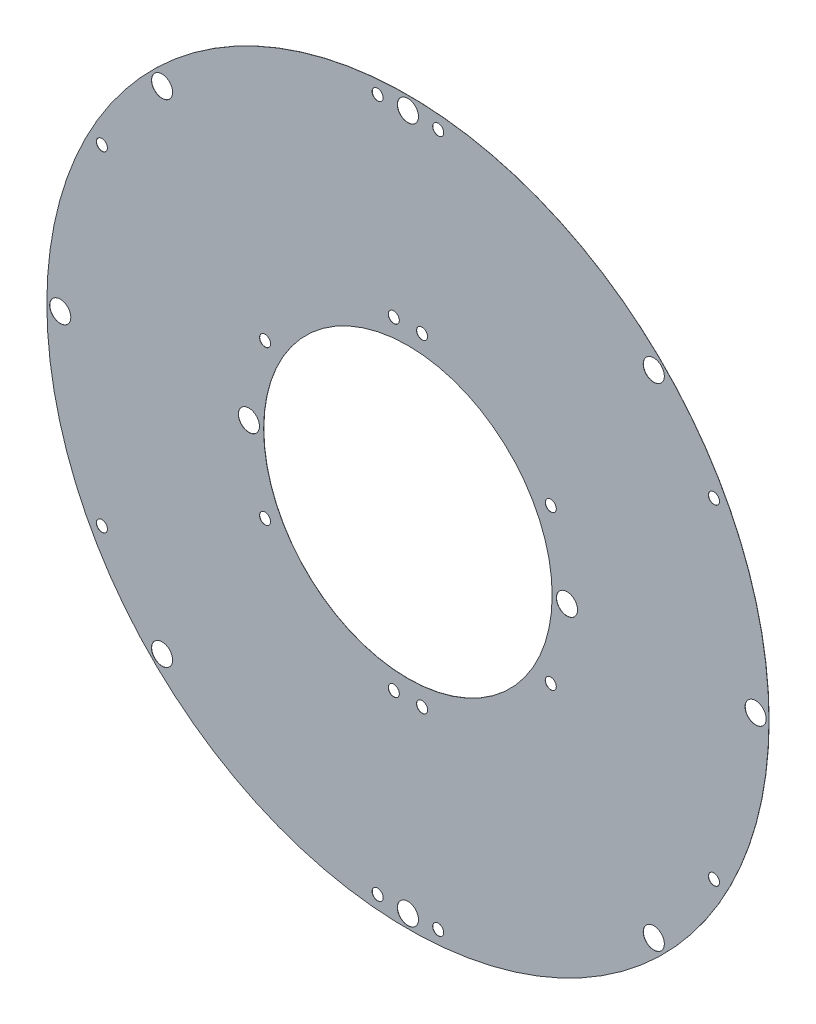
ISO-10303-21;
HEADER;
FILE_DESCRIPTION(('STEP AP214'),'2;1');
FILE_NAME('part.step','',(''),(''),'','','');
FILE_SCHEMA(('AUTOMOTIVE_DESIGN { 1 0 10303 214 1 1 1 1 }'));
ENDSEC;
DATA;
#1=APPLICATION_CONTEXT('core data for automotive mechanical design processes');
#2=APPLICATION_PROTOCOL_DEFINITION('international standard','automotive_design',2000,#1);
#3=PRODUCT_CONTEXT('',#1,'mechanical');
#4=PRODUCT('Part','Part','',(#3));
#5=PRODUCT_RELATED_PRODUCT_CATEGORY('part','',(#4));
#6=PRODUCT_DEFINITION_FORMATION('','',#4);
#7=PRODUCT_DEFINITION_CONTEXT('part definition',#1,'design');
#8=PRODUCT_DEFINITION('design','',#6,#7);
#9=PRODUCT_DEFINITION_SHAPE('','',#8);
#10=(LENGTH_UNIT() NAMED_UNIT(*) SI_UNIT(.MILLI.,.METRE.));
#11=(NAMED_UNIT(*) PLANE_ANGLE_UNIT() SI_UNIT($,.RADIAN.));
#12=(NAMED_UNIT(*) SI_UNIT($,.STERADIAN.) SOLID_ANGLE_UNIT());
#13=UNCERTAINTY_MEASURE_WITH_UNIT(LENGTH_MEASURE(1.E-05),#10,'distance_accuracy_value','');
#14=(GEOMETRIC_REPRESENTATION_CONTEXT(3) GLOBAL_UNCERTAINTY_ASSIGNED_CONTEXT((#13)) GLOBAL_UNIT_ASSIGNED_CONTEXT((#10,
#11,#12)) REPRESENTATION_CONTEXT('',''));
#15=CARTESIAN_POINT('',(0.,0.,0.));
#16=DIRECTION('',(0.,0.,1.));
#17=DIRECTION('',(1.,0.,0.));
#18=AXIS2_PLACEMENT_3D('',#15,#16,#17);
#19=CARTESIAN_POINT('',(0.,0.,-6.35));
#20=DIRECTION('',(0.,0.,-1.));
#21=DIRECTION('',(-1.,0.,0.));
#22=AXIS2_PLACEMENT_3D('',#19,#20,#21);
#23=PLANE('',#22);
#24=CARTESIAN_POINT('',(0.,107.125,-6.35));
#25=DIRECTION('',(0.,0.,-1.));
#26=DIRECTION('',(-1.,0.,0.));
#27=AXIS2_PLACEMENT_3D('',#24,#25,#26);
#28=CIRCLE('',#27,3.25);
#29=CARTESIAN_POINT('',(-3.25,107.125,-6.35));
#30=VERTEX_POINT('',#29);
#31=EDGE_CURVE('E199',#30,#30,#28,.T.);
#32=ORIENTED_EDGE('',*,*,#31,.T.);
#33=EDGE_LOOP('',(#32));
#34=FACE_BOUND('',#33,.T.);
#35=CARTESIAN_POINT('',(75.748813934609,75.7488139346088,-6.35));
#36=DIRECTION('',(0.,0.,-1.));
#37=DIRECTION('',(-1.,0.,0.));
#38=AXIS2_PLACEMENT_3D('',#35,#36,#37);
#39=CIRCLE('',#38,3.25);
#40=CARTESIAN_POINT('',(72.498813934609,75.7488139346088,-6.35));
#41=VERTEX_POINT('',#40);
#42=EDGE_CURVE('E193',#41,#41,#39,.T.);
#43=ORIENTED_EDGE('',*,*,#42,.T.);
#44=EDGE_LOOP('',(#43));
#45=FACE_BOUND('',#44,.T.);
#46=CARTESIAN_POINT('',(107.125,3.44291778045328E-13,-6.35));
#47=DIRECTION('',(0.,0.,-1.));
#48=DIRECTION('',(-1.,0.,0.));
#49=AXIS2_PLACEMENT_3D('',#46,#47,#48);
#50=CIRCLE('',#49,3.25);
#51=CARTESIAN_POINT('',(103.875,3.44291778045328E-13,-6.35));
#52=VERTEX_POINT('',#51);
#53=EDGE_CURVE('E187',#52,#52,#50,.T.);
#54=ORIENTED_EDGE('',*,*,#53,.T.);
#55=EDGE_LOOP('',(#54));
#56=FACE_BOUND('',#55,.T.);
#57=CARTESIAN_POINT('',(75.748813934609,-75.7488139346088,-6.35));
#58=DIRECTION('',(0.,0.,-1.));
#59=DIRECTION('',(-1.,0.,0.));
#60=AXIS2_PLACEMENT_3D('',#57,#58,#59);
#61=CIRCLE('',#60,3.25);
#62=CARTESIAN_POINT('',(72.498813934609,-75.7488139346088,-6.35));
#63=VERTEX_POINT('',#62);
#64=EDGE_CURVE('E181',#63,#63,#61,.T.);
#65=ORIENTED_EDGE('',*,*,#64,.T.);
#66=EDGE_LOOP('',(#65));
#67=FACE_BOUND('',#66,.T.);
#68=CARTESIAN_POINT('',(0.,-107.125,-6.35));
#69=DIRECTION('',(0.,0.,-1.));
#70=DIRECTION('',(-1.,0.,0.));
#71=AXIS2_PLACEMENT_3D('',#68,#69,#70);
#72=CIRCLE('',#71,3.25);
#73=CARTESIAN_POINT('',(-3.25000000000002,-107.125,-6.35));
#74=VERTEX_POINT('',#73);
#75=EDGE_CURVE('E175',#74,#74,#72,.T.);
#76=ORIENTED_EDGE('',*,*,#75,.T.);
#77=EDGE_LOOP('',(#76));
#78=FACE_BOUND('',#77,.T.);
#79=CARTESIAN_POINT('',(-75.748813934608,-75.7488139346098,-6.35));
#80=DIRECTION('',(0.,0.,-1.));
#81=DIRECTION('',(-1.,0.,0.));
#82=AXIS2_PLACEMENT_3D('',#79,#80,#81);
#83=CIRCLE('',#82,3.25);
#84=CARTESIAN_POINT('',(-78.998813934608,-75.7488139346098,-6.35));
#85=VERTEX_POINT('',#84);
#86=EDGE_CURVE('E169',#85,#85,#83,.T.);
#87=ORIENTED_EDGE('',*,*,#86,.T.);
#88=EDGE_LOOP('',(#87));
#89=FACE_BOUND('',#88,.T.);
#90=CARTESIAN_POINT('',(-107.125,-1.09234165489247E-12,-6.35));
#91=DIRECTION('',(0.,0.,-1.));
#92=DIRECTION('',(-1.,0.,0.));
#93=AXIS2_PLACEMENT_3D('',#90,#91,#92);
#94=CIRCLE('',#93,3.25);
#95=CARTESIAN_POINT('',(-110.375,-1.09234165489247E-12,-6.35));
#96=VERTEX_POINT('',#95);
#97=EDGE_CURVE('E163',#96,#96,#94,.T.);
#98=ORIENTED_EDGE('',*,*,#97,.T.);
#99=EDGE_LOOP('',(#98));
#100=FACE_BOUND('',#99,.T.);
#101=CARTESIAN_POINT('',(-49.,0.,-6.35));
#102=DIRECTION('',(0.,0.,-1.));
#103=DIRECTION('',(-1.,0.,0.));
#104=AXIS2_PLACEMENT_3D('',#101,#102,#103);
#105=CIRCLE('',#104,3.25);
#106=CARTESIAN_POINT('',(-52.25,0.,-6.35));
#107=VERTEX_POINT('',#106);
#108=EDGE_CURVE('E157',#107,#107,#105,.T.);
#109=ORIENTED_EDGE('',*,*,#108,.T.);
#110=EDGE_LOOP('',(#109));
#111=FACE_BOUND('',#110,.T.);
#112=CARTESIAN_POINT('',(49.,0.,-6.35));
#113=DIRECTION('',(0.,0.,-1.));
#114=DIRECTION('',(-1.,0.,0.));
#115=AXIS2_PLACEMENT_3D('',#112,#113,#114);
#116=CIRCLE('',#115,3.25);
#117=CARTESIAN_POINT('',(45.75,0.,-6.35));
#118=VERTEX_POINT('',#117);
#119=EDGE_CURVE('E151',#118,#118,#116,.T.);
#120=ORIENTED_EDGE('',*,*,#119,.T.);
#121=EDGE_LOOP('',(#120));
#122=FACE_BOUND('',#121,.T.);
#123=CARTESIAN_POINT('',(-75.748813934608,75.7488139346098,-6.35));
#124=DIRECTION('',(0.,0.,-1.));
#125=DIRECTION('',(-1.,0.,0.));
#126=AXIS2_PLACEMENT_3D('',#123,#124,#125);
#127=CIRCLE('',#126,3.25);
#128=CARTESIAN_POINT('',(-78.998813934608,75.7488139346098,-6.35));
#129=VERTEX_POINT('',#128);
#130=EDGE_CURVE('E36',#129,#129,#127,.T.);
#131=ORIENTED_EDGE('',*,*,#130,.T.);
#132=EDGE_LOOP('',(#131));
#133=FACE_BOUND('',#132,.T.);
#134=CARTESIAN_POINT('',(0.,0.,-6.35));
#135=DIRECTION('',(0.,0.,-1.));
#136=DIRECTION('',(-1.,0.,0.));
#137=AXIS2_PLACEMENT_3D('',#134,#135,#136);
#138=CIRCLE('',#137,44.45);
#139=CARTESIAN_POINT('',(-44.45,0.,-6.35));
#140=VERTEX_POINT('',#139);
#141=EDGE_CURVE('E47',#140,#140,#138,.T.);
#142=ORIENTED_EDGE('',*,*,#141,.T.);
#143=EDGE_LOOP('',(#142));
#144=FACE_BOUND('',#143,.T.);
#145=CARTESIAN_POINT('',(0.,0.,-6.35));
#146=DIRECTION('',(0.,0.,-1.));
#147=DIRECTION('',(-1.,0.,0.));
#148=AXIS2_PLACEMENT_3D('',#145,#146,#147);
#149=CIRCLE('',#148,111.25);
#150=CARTESIAN_POINT('',(-111.25,0.,-6.35));
#151=VERTEX_POINT('',#150);
#152=EDGE_CURVE('E40',#151,#151,#149,.T.);
#153=ORIENTED_EDGE('',*,*,#152,.F.);
#154=EDGE_LOOP('',(#153));
#155=FACE_BOUND('',#154,.T.);
#156=CARTESIAN_POINT('',(44.0100695590055,23.7300184873822,-6.35));
#157=DIRECTION('',(0.,0.,-1.));
#158=DIRECTION('',(-1.,0.,0.));
#159=AXIS2_PLACEMENT_3D('',#156,#157,#158);
#160=CIRCLE('',#159,1.7);
#161=CARTESIAN_POINT('',(42.3100695590054,23.7300184873822,-6.35));
#162=VERTEX_POINT('',#161);
#163=EDGE_CURVE('E50',#162,#162,#160,.T.);
#164=ORIENTED_EDGE('',*,*,#163,.T.);
#165=EDGE_LOOP('',(#164));
#166=FACE_BOUND('',#165,.T.);
#167=CARTESIAN_POINT('',(9.33655894184218,106.717357033078,-6.35));
#168=DIRECTION('',(0.,0.,-1.));
#169=DIRECTION('',(-1.,0.,0.));
#170=AXIS2_PLACEMENT_3D('',#167,#168,#169);
#171=CIRCLE('',#170,1.7);
#172=CARTESIAN_POINT('',(7.63655894184217,106.717357033078,-6.35));
#173=VERTEX_POINT('',#172);
#174=EDGE_CURVE('E58',#173,#173,#171,.T.);
#175=ORIENTED_EDGE('',*,*,#174,.T.);
#176=EDGE_LOOP('',(#175));
#177=FACE_BOUND('',#176,.T.);
#178=CARTESIAN_POINT('',(94.2915740301692,50.8415646092164,-6.35));
#179=DIRECTION('',(0.,0.,-1.));
#180=DIRECTION('',(-1.,0.,0.));
#181=AXIS2_PLACEMENT_3D('',#178,#179,#180);
#182=CIRCLE('',#181,1.69999999999999);
#183=CARTESIAN_POINT('',(92.5915740301692,50.8415646092164,-6.35));
#184=VERTEX_POINT('',#183);
#185=EDGE_CURVE('E64',#184,#184,#182,.T.);
#186=ORIENTED_EDGE('',*,*,#185,.T.);
#187=EDGE_LOOP('',(#186));
#188=FACE_BOUND('',#187,.T.);
#189=CARTESIAN_POINT('',(4.35778713738258,49.8097349045873,-6.35));
#190=DIRECTION('',(0.,0.,-1.));
#191=DIRECTION('',(-1.,0.,0.));
#192=AXIS2_PLACEMENT_3D('',#189,#190,#191);
#193=CIRCLE('',#192,1.7);
#194=CARTESIAN_POINT('',(2.65778713738258,49.8097349045873,-6.35));
#195=VERTEX_POINT('',#194);
#196=EDGE_CURVE('E70',#195,#195,#193,.T.);
#197=ORIENTED_EDGE('',*,*,#196,.T.);
#198=EDGE_LOOP('',(#197));
#199=FACE_BOUND('',#198,.T.);
#200=CARTESIAN_POINT('',(-4.35778713738291,49.8097349045873,-6.35));
#201=DIRECTION('',(0.,0.,-1.));
#202=DIRECTION('',(-1.,0.,0.));
#203=AXIS2_PLACEMENT_3D('',#200,#201,#202);
#204=CIRCLE('',#203,1.7);
#205=CARTESIAN_POINT('',(-6.05778713738291,49.8097349045873,-6.35));
#206=VERTEX_POINT('',#205);
#207=EDGE_CURVE('E76',#206,#206,#204,.T.);
#208=ORIENTED_EDGE('',*,*,#207,.T.);
#209=EDGE_LOOP('',(#208));
#210=FACE_BOUND('',#209,.T.);
#211=CARTESIAN_POINT('',(-44.0100695590056,23.7300184873819,-6.35));
#212=DIRECTION('',(0.,0.,-1.));
#213=DIRECTION('',(-1.,0.,0.));
#214=AXIS2_PLACEMENT_3D('',#211,#212,#213);
#215=CIRCLE('',#214,1.7);
#216=CARTESIAN_POINT('',(-45.7100695590056,23.7300184873819,-6.35));
#217=VERTEX_POINT('',#216);
#218=EDGE_CURVE('E82',#217,#217,#215,.T.);
#219=ORIENTED_EDGE('',*,*,#218,.T.);
#220=EDGE_LOOP('',(#219));
#221=FACE_BOUND('',#220,.T.);
#222=CARTESIAN_POINT('',(-94.2915740301695,50.8415646092158,-6.35));
#223=DIRECTION('',(0.,0.,-1.));
#224=DIRECTION('',(-1.,0.,0.));
#225=AXIS2_PLACEMENT_3D('',#222,#223,#224);
#226=CIRCLE('',#225,1.69999999999999);
#227=CARTESIAN_POINT('',(-95.9915740301695,50.8415646092158,-6.35));
#228=VERTEX_POINT('',#227);
#229=EDGE_CURVE('E88',#228,#228,#226,.T.);
#230=ORIENTED_EDGE('',*,*,#229,.T.);
#231=EDGE_LOOP('',(#230));
#232=FACE_BOUND('',#231,.T.);
#233=CARTESIAN_POINT('',(-9.33655894184289,106.717357033078,-6.35));
#234=DIRECTION('',(0.,0.,-1.));
#235=DIRECTION('',(-1.,0.,0.));
#236=AXIS2_PLACEMENT_3D('',#233,#234,#235);
#237=CIRCLE('',#236,1.7);
#238=CARTESIAN_POINT('',(-11.0365589418429,106.717357033078,-6.35));
#239=VERTEX_POINT('',#238);
#240=EDGE_CURVE('E94',#239,#239,#237,.T.);
#241=ORIENTED_EDGE('',*,*,#240,.T.);
#242=EDGE_LOOP('',(#241));
#243=FACE_BOUND('',#242,.T.);
#244=CARTESIAN_POINT('',(44.0100695590055,-23.7300184873822,-6.35));
#245=DIRECTION('',(0.,0.,-1.));
#246=DIRECTION('',(-1.,0.,0.));
#247=AXIS2_PLACEMENT_3D('',#244,#245,#246);
#248=CIRCLE('',#247,1.7);
#249=CARTESIAN_POINT('',(42.3100695590054,-23.7300184873822,-6.35));
#250=VERTEX_POINT('',#249);
#251=EDGE_CURVE('E100',#250,#250,#248,.T.);
#252=ORIENTED_EDGE('',*,*,#251,.T.);
#253=EDGE_LOOP('',(#252));
#254=FACE_BOUND('',#253,.T.);
#255=CARTESIAN_POINT('',(9.33655894184218,-106.717357033078,-6.35));
#256=DIRECTION('',(0.,0.,-1.));
#257=DIRECTION('',(-1.,0.,0.));
#258=AXIS2_PLACEMENT_3D('',#255,#256,#257);
#259=CIRCLE('',#258,1.7);
#260=CARTESIAN_POINT('',(7.63655894184217,-106.717357033078,-6.35));
#261=VERTEX_POINT('',#260);
#262=EDGE_CURVE('E106',#261,#261,#259,.T.);
#263=ORIENTED_EDGE('',*,*,#262,.T.);
#264=EDGE_LOOP('',(#263));
#265=FACE_BOUND('',#264,.T.);
#266=CARTESIAN_POINT('',(94.2915740301692,-50.8415646092164,-6.35));
#267=DIRECTION('',(0.,0.,-1.));
#268=DIRECTION('',(-1.,0.,0.));
#269=AXIS2_PLACEMENT_3D('',#266,#267,#268);
#270=CIRCLE('',#269,1.69999999999999);
#271=CARTESIAN_POINT('',(92.5915740301692,-50.8415646092164,-6.35));
#272=VERTEX_POINT('',#271);
#273=EDGE_CURVE('E112',#272,#272,#270,.T.);
#274=ORIENTED_EDGE('',*,*,#273,.T.);
#275=EDGE_LOOP('',(#274));
#276=FACE_BOUND('',#275,.T.);
#277=CARTESIAN_POINT('',(4.35778713738258,-49.8097349045873,-6.35));
#278=DIRECTION('',(0.,0.,-1.));
#279=DIRECTION('',(-1.,0.,0.));
#280=AXIS2_PLACEMENT_3D('',#277,#278,#279);
#281=CIRCLE('',#280,1.7);
#282=CARTESIAN_POINT('',(2.65778713738258,-49.8097349045873,-6.35));
#283=VERTEX_POINT('',#282);
#284=EDGE_CURVE('E118',#283,#283,#281,.T.);
#285=ORIENTED_EDGE('',*,*,#284,.T.);
#286=EDGE_LOOP('',(#285));
#287=FACE_BOUND('',#286,.T.);
#288=CARTESIAN_POINT('',(-4.35778713738291,-49.8097349045873,-6.35));
#289=DIRECTION('',(0.,0.,-1.));
#290=DIRECTION('',(-1.,0.,0.));
#291=AXIS2_PLACEMENT_3D('',#288,#289,#290);
#292=CIRCLE('',#291,1.7);
#293=CARTESIAN_POINT('',(-6.05778713738291,-49.8097349045873,-6.35));
#294=VERTEX_POINT('',#293);
#295=EDGE_CURVE('E124',#294,#294,#292,.T.);
#296=ORIENTED_EDGE('',*,*,#295,.T.);
#297=EDGE_LOOP('',(#296));
#298=FACE_BOUND('',#297,.T.);
#299=CARTESIAN_POINT('',(-44.0100695590056,-23.7300184873819,-6.35));
#300=DIRECTION('',(0.,0.,-1.));
#301=DIRECTION('',(-1.,0.,0.));
#302=AXIS2_PLACEMENT_3D('',#299,#300,#301);
#303=CIRCLE('',#302,1.7);
#304=CARTESIAN_POINT('',(-45.7100695590056,-23.7300184873819,-6.35));
#305=VERTEX_POINT('',#304);
#306=EDGE_CURVE('E130',#305,#305,#303,.T.);
#307=ORIENTED_EDGE('',*,*,#306,.T.);
#308=EDGE_LOOP('',(#307));
#309=FACE_BOUND('',#308,.T.);
#310=CARTESIAN_POINT('',(-94.2915740301695,-50.8415646092158,-6.35));
#311=DIRECTION('',(0.,0.,-1.));
#312=DIRECTION('',(-1.,0.,0.));
#313=AXIS2_PLACEMENT_3D('',#310,#311,#312);
#314=CIRCLE('',#313,1.69999999999999);
#315=CARTESIAN_POINT('',(-95.9915740301695,-50.8415646092158,-6.35));
#316=VERTEX_POINT('',#315);
#317=EDGE_CURVE('E136',#316,#316,#314,.T.);
#318=ORIENTED_EDGE('',*,*,#317,.T.);
#319=EDGE_LOOP('',(#318));
#320=FACE_BOUND('',#319,.T.);
#321=CARTESIAN_POINT('',(-9.33655894184289,-106.717357033078,-6.35));
#322=DIRECTION('',(0.,0.,-1.));
#323=DIRECTION('',(-1.,0.,0.));
#324=AXIS2_PLACEMENT_3D('',#321,#322,#323);
#325=CIRCLE('',#324,1.7);
#326=CARTESIAN_POINT('',(-11.0365589418429,-106.717357033078,-6.35));
#327=VERTEX_POINT('',#326);
#328=EDGE_CURVE('E142',#327,#327,#325,.T.);
#329=ORIENTED_EDGE('',*,*,#328,.T.);
#330=EDGE_LOOP('',(#329));
#331=FACE_BOUND('',#330,.T.);
#332=ADVANCED_FACE('F32',(#34,#45,#56,#67,#78,#89,#100,#111,#122,#133,#144,#155,#166,#177,#188,
#199,#210,#221,#232,#243,#254,#265,#276,#287,#298,#309,#320,#331),#23,.F.);
#333=CARTESIAN_POINT('',(0.,0.,-6.4));
#334=DIRECTION('',(0.,0.,-1.));
#335=DIRECTION('',(-1.,0.,0.));
#336=AXIS2_PLACEMENT_3D('',#333,#334,#335);
#337=PLANE('',#336);
#338=CARTESIAN_POINT('',(0.,107.125,-6.4));
#339=DIRECTION('',(0.,0.,-1.));
#340=DIRECTION('',(-1.,0.,0.));
#341=AXIS2_PLACEMENT_3D('',#338,#339,#340);
#342=CIRCLE('',#341,3.25);
#343=CARTESIAN_POINT('',(-3.25,107.125,-6.4));
#344=VERTEX_POINT('',#343);
#345=EDGE_CURVE('E202',#344,#344,#342,.T.);
#346=ORIENTED_EDGE('',*,*,#345,.F.);
#347=EDGE_LOOP('',(#346));
#348=FACE_BOUND('',#347,.T.);
#349=CARTESIAN_POINT('',(75.748813934609,75.7488139346088,-6.4));
#350=DIRECTION('',(0.,0.,-1.));
#351=DIRECTION('',(-1.,0.,0.));
#352=AXIS2_PLACEMENT_3D('',#349,#350,#351);
#353=CIRCLE('',#352,3.25);
#354=CARTESIAN_POINT('',(72.498813934609,75.7488139346088,-6.4));
#355=VERTEX_POINT('',#354);
#356=EDGE_CURVE('E196',#355,#355,#353,.T.);
#357=ORIENTED_EDGE('',*,*,#356,.F.);
#358=EDGE_LOOP('',(#357));
#359=FACE_BOUND('',#358,.T.);
#360=CARTESIAN_POINT('',(107.125,3.44291778045328E-13,-6.4));
#361=DIRECTION('',(0.,0.,-1.));
#362=DIRECTION('',(-1.,0.,0.));
#363=AXIS2_PLACEMENT_3D('',#360,#361,#362);
#364=CIRCLE('',#363,3.25);
#365=CARTESIAN_POINT('',(103.875,3.44291778045328E-13,-6.4));
#366=VERTEX_POINT('',#365);
#367=EDGE_CURVE('E190',#366,#366,#364,.T.);
#368=ORIENTED_EDGE('',*,*,#367,.F.);
#369=EDGE_LOOP('',(#368));
#370=FACE_BOUND('',#369,.T.);
#371=CARTESIAN_POINT('',(75.748813934609,-75.7488139346088,-6.4));
#372=DIRECTION('',(0.,0.,-1.));
#373=DIRECTION('',(-1.,0.,0.));
#374=AXIS2_PLACEMENT_3D('',#371,#372,#373);
#375=CIRCLE('',#374,3.25);
#376=CARTESIAN_POINT('',(72.498813934609,-75.7488139346088,-6.4));
#377=VERTEX_POINT('',#376);
#378=EDGE_CURVE('E184',#377,#377,#375,.T.);
#379=ORIENTED_EDGE('',*,*,#378,.F.);
#380=EDGE_LOOP('',(#379));
#381=FACE_BOUND('',#380,.T.);
#382=CARTESIAN_POINT('',(0.,-107.125,-6.4));
#383=DIRECTION('',(0.,0.,-1.));
#384=DIRECTION('',(-1.,0.,0.));
#385=AXIS2_PLACEMENT_3D('',#382,#383,#384);
#386=CIRCLE('',#385,3.25);
#387=CARTESIAN_POINT('',(-3.25000000000002,-107.125,-6.4));
#388=VERTEX_POINT('',#387);
#389=EDGE_CURVE('E178',#388,#388,#386,.T.);
#390=ORIENTED_EDGE('',*,*,#389,.F.);
#391=EDGE_LOOP('',(#390));
#392=FACE_BOUND('',#391,.T.);
#393=CARTESIAN_POINT('',(-75.748813934608,-75.7488139346098,-6.4));
#394=DIRECTION('',(0.,0.,-1.));
#395=DIRECTION('',(-1.,0.,0.));
#396=AXIS2_PLACEMENT_3D('',#393,#394,#395);
#397=CIRCLE('',#396,3.25);
#398=CARTESIAN_POINT('',(-78.998813934608,-75.7488139346098,-6.4));
#399=VERTEX_POINT('',#398);
#400=EDGE_CURVE('E172',#399,#399,#397,.T.);
#401=ORIENTED_EDGE('',*,*,#400,.F.);
#402=EDGE_LOOP('',(#401));
#403=FACE_BOUND('',#402,.T.);
#404=CARTESIAN_POINT('',(-107.125,-1.09234165489247E-12,-6.4));
#405=DIRECTION('',(0.,0.,-1.));
#406=DIRECTION('',(-1.,0.,0.));
#407=AXIS2_PLACEMENT_3D('',#404,#405,#406);
#408=CIRCLE('',#407,3.25);
#409=CARTESIAN_POINT('',(-110.375,-1.09234165489247E-12,-6.4));
#410=VERTEX_POINT('',#409);
#411=EDGE_CURVE('E166',#410,#410,#408,.T.);
#412=ORIENTED_EDGE('',*,*,#411,.F.);
#413=EDGE_LOOP('',(#412));
#414=FACE_BOUND('',#413,.T.);
#415=CARTESIAN_POINT('',(-49.,0.,-6.4));
#416=DIRECTION('',(0.,0.,-1.));
#417=DIRECTION('',(-1.,0.,0.));
#418=AXIS2_PLACEMENT_3D('',#415,#416,#417);
#419=CIRCLE('',#418,3.25);
#420=CARTESIAN_POINT('',(-52.25,0.,-6.4));
#421=VERTEX_POINT('',#420);
#422=EDGE_CURVE('E160',#421,#421,#419,.T.);
#423=ORIENTED_EDGE('',*,*,#422,.F.);
#424=EDGE_LOOP('',(#423));
#425=FACE_BOUND('',#424,.T.);
#426=CARTESIAN_POINT('',(49.,0.,-6.4));
#427=DIRECTION('',(0.,0.,-1.));
#428=DIRECTION('',(-1.,0.,0.));
#429=AXIS2_PLACEMENT_3D('',#426,#427,#428);
#430=CIRCLE('',#429,3.25);
#431=CARTESIAN_POINT('',(45.75,0.,-6.4));
#432=VERTEX_POINT('',#431);
#433=EDGE_CURVE('E154',#432,#432,#430,.T.);
#434=ORIENTED_EDGE('',*,*,#433,.F.);
#435=EDGE_LOOP('',(#434));
#436=FACE_BOUND('',#435,.T.);
#437=CARTESIAN_POINT('',(-75.748813934608,75.7488139346098,-6.4));
#438=DIRECTION('',(0.,0.,-1.));
#439=DIRECTION('',(-1.,0.,0.));
#440=AXIS2_PLACEMENT_3D('',#437,#438,#439);
#441=CIRCLE('',#440,3.25);
#442=CARTESIAN_POINT('',(-78.998813934608,75.7488139346098,-6.4));
#443=VERTEX_POINT('',#442);
#444=EDGE_CURVE('E148',#443,#443,#441,.T.);
#445=ORIENTED_EDGE('',*,*,#444,.F.);
#446=EDGE_LOOP('',(#445));
#447=FACE_BOUND('',#446,.T.);
#448=CARTESIAN_POINT('',(-9.33655894184289,-106.717357033078,-6.4));
#449=DIRECTION('',(0.,0.,-1.));
#450=DIRECTION('',(-1.,0.,0.));
#451=AXIS2_PLACEMENT_3D('',#448,#449,#450);
#452=CIRCLE('',#451,1.69999999999999);
#453=CARTESIAN_POINT('',(-11.0365589418429,-106.717357033078,-6.4));
#454=VERTEX_POINT('',#453);
#455=EDGE_CURVE('E145',#454,#454,#452,.T.);
#456=ORIENTED_EDGE('',*,*,#455,.F.);
#457=EDGE_LOOP('',(#456));
#458=FACE_BOUND('',#457,.T.);
#459=CARTESIAN_POINT('',(-94.2915740301695,-50.8415646092158,-6.4));
#460=DIRECTION('',(0.,0.,-1.));
#461=DIRECTION('',(-1.,0.,0.));
#462=AXIS2_PLACEMENT_3D('',#459,#460,#461);
#463=CIRCLE('',#462,1.69999999999999);
#464=CARTESIAN_POINT('',(-95.9915740301695,-50.8415646092158,-6.4));
#465=VERTEX_POINT('',#464);
#466=EDGE_CURVE('E139',#465,#465,#463,.T.);
#467=ORIENTED_EDGE('',*,*,#466,.F.);
#468=EDGE_LOOP('',(#467));
#469=FACE_BOUND('',#468,.T.);
#470=CARTESIAN_POINT('',(-44.0100695590056,-23.7300184873819,-6.4));
#471=DIRECTION('',(0.,0.,-1.));
#472=DIRECTION('',(-1.,0.,0.));
#473=AXIS2_PLACEMENT_3D('',#470,#471,#472);
#474=CIRCLE('',#473,1.69999999999999);
#475=CARTESIAN_POINT('',(-45.7100695590056,-23.7300184873819,-6.4));
#476=VERTEX_POINT('',#475);
#477=EDGE_CURVE('E133',#476,#476,#474,.T.);
#478=ORIENTED_EDGE('',*,*,#477,.F.);
#479=EDGE_LOOP('',(#478));
#480=FACE_BOUND('',#479,.T.);
#481=CARTESIAN_POINT('',(-4.35778713738291,-49.8097349045873,-6.4));
#482=DIRECTION('',(0.,0.,-1.));
#483=DIRECTION('',(-1.,0.,0.));
#484=AXIS2_PLACEMENT_3D('',#481,#482,#483);
#485=CIRCLE('',#484,1.69999999999999);
#486=CARTESIAN_POINT('',(-6.0577871373829,-49.8097349045873,-6.4));
#487=VERTEX_POINT('',#486);
#488=EDGE_CURVE('E127',#487,#487,#485,.T.);
#489=ORIENTED_EDGE('',*,*,#488,.F.);
#490=EDGE_LOOP('',(#489));
#491=FACE_BOUND('',#490,.T.);
#492=CARTESIAN_POINT('',(4.35778713738258,-49.8097349045873,-6.4));
#493=DIRECTION('',(0.,0.,-1.));
#494=DIRECTION('',(-1.,0.,0.));
#495=AXIS2_PLACEMENT_3D('',#492,#493,#494);
#496=CIRCLE('',#495,1.69999999999999);
#497=CARTESIAN_POINT('',(2.65778713738259,-49.8097349045873,-6.4));
#498=VERTEX_POINT('',#497);
#499=EDGE_CURVE('E121',#498,#498,#496,.T.);
#500=ORIENTED_EDGE('',*,*,#499,.F.);
#501=EDGE_LOOP('',(#500));
#502=FACE_BOUND('',#501,.T.);
#503=CARTESIAN_POINT('',(94.2915740301692,-50.8415646092164,-6.4));
#504=DIRECTION('',(0.,0.,-1.));
#505=DIRECTION('',(-1.,0.,0.));
#506=AXIS2_PLACEMENT_3D('',#503,#504,#505);
#507=CIRCLE('',#506,1.69999999999999);
#508=CARTESIAN_POINT('',(92.5915740301692,-50.8415646092164,-6.4));
#509=VERTEX_POINT('',#508);
#510=EDGE_CURVE('E115',#509,#509,#507,.T.);
#511=ORIENTED_EDGE('',*,*,#510,.F.);
#512=EDGE_LOOP('',(#511));
#513=FACE_BOUND('',#512,.T.);
#514=CARTESIAN_POINT('',(9.33655894184218,-106.717357033078,-6.4));
#515=DIRECTION('',(0.,0.,-1.));
#516=DIRECTION('',(-1.,0.,0.));
#517=AXIS2_PLACEMENT_3D('',#514,#515,#516);
#518=CIRCLE('',#517,1.69999999999999);
#519=CARTESIAN_POINT('',(7.63655894184219,-106.717357033078,-6.4));
#520=VERTEX_POINT('',#519);
#521=EDGE_CURVE('E109',#520,#520,#518,.T.);
#522=ORIENTED_EDGE('',*,*,#521,.F.);
#523=EDGE_LOOP('',(#522));
#524=FACE_BOUND('',#523,.T.);
#525=CARTESIAN_POINT('',(44.0100695590055,-23.7300184873822,-6.4));
#526=DIRECTION('',(0.,0.,-1.));
#527=DIRECTION('',(-1.,0.,0.));
#528=AXIS2_PLACEMENT_3D('',#525,#526,#527);
#529=CIRCLE('',#528,1.69999999999999);
#530=CARTESIAN_POINT('',(42.3100695590055,-23.7300184873822,-6.4));
#531=VERTEX_POINT('',#530);
#532=EDGE_CURVE('E103',#531,#531,#529,.T.);
#533=ORIENTED_EDGE('',*,*,#532,.F.);
#534=EDGE_LOOP('',(#533));
#535=FACE_BOUND('',#534,.T.);
#536=CARTESIAN_POINT('',(-9.33655894184289,106.717357033078,-6.4));
#537=DIRECTION('',(0.,0.,-1.));
#538=DIRECTION('',(-1.,0.,0.));
#539=AXIS2_PLACEMENT_3D('',#536,#537,#538);
#540=CIRCLE('',#539,1.69999999999999);
#541=CARTESIAN_POINT('',(-11.0365589418429,106.717357033078,-6.4));
#542=VERTEX_POINT('',#541);
#543=EDGE_CURVE('E97',#542,#542,#540,.T.);
#544=ORIENTED_EDGE('',*,*,#543,.F.);
#545=EDGE_LOOP('',(#544));
#546=FACE_BOUND('',#545,.T.);
#547=CARTESIAN_POINT('',(-94.2915740301695,50.8415646092158,-6.4));
#548=DIRECTION('',(0.,0.,-1.));
#549=DIRECTION('',(-1.,0.,0.));
#550=AXIS2_PLACEMENT_3D('',#547,#548,#549);
#551=CIRCLE('',#550,1.69999999999999);
#552=CARTESIAN_POINT('',(-95.9915740301695,50.8415646092158,-6.4));
#553=VERTEX_POINT('',#552);
#554=EDGE_CURVE('E91',#553,#553,#551,.T.);
#555=ORIENTED_EDGE('',*,*,#554,.F.);
#556=EDGE_LOOP('',(#555));
#557=FACE_BOUND('',#556,.T.);
#558=CARTESIAN_POINT('',(-44.0100695590056,23.7300184873819,-6.4));
#559=DIRECTION('',(0.,0.,-1.));
#560=DIRECTION('',(-1.,0.,0.));
#561=AXIS2_PLACEMENT_3D('',#558,#559,#560);
#562=CIRCLE('',#561,1.69999999999999);
#563=CARTESIAN_POINT('',(-45.7100695590056,23.7300184873819,-6.4));
#564=VERTEX_POINT('',#563);
#565=EDGE_CURVE('E85',#564,#564,#562,.T.);
#566=ORIENTED_EDGE('',*,*,#565,.F.);
#567=EDGE_LOOP('',(#566));
#568=FACE_BOUND('',#567,.T.);
#569=CARTESIAN_POINT('',(-4.35778713738291,49.8097349045873,-6.4));
#570=DIRECTION('',(0.,0.,-1.));
#571=DIRECTION('',(-1.,0.,0.));
#572=AXIS2_PLACEMENT_3D('',#569,#570,#571);
#573=CIRCLE('',#572,1.69999999999999);
#574=CARTESIAN_POINT('',(-6.0577871373829,49.8097349045873,-6.4));
#575=VERTEX_POINT('',#574);
#576=EDGE_CURVE('E79',#575,#575,#573,.T.);
#577=ORIENTED_EDGE('',*,*,#576,.F.);
#578=EDGE_LOOP('',(#577));
#579=FACE_BOUND('',#578,.T.);
#580=CARTESIAN_POINT('',(4.35778713738258,49.8097349045873,-6.4));
#581=DIRECTION('',(0.,0.,-1.));
#582=DIRECTION('',(-1.,0.,0.));
#583=AXIS2_PLACEMENT_3D('',#580,#581,#582);
#584=CIRCLE('',#583,1.69999999999999);
#585=CARTESIAN_POINT('',(2.65778713738259,49.8097349045873,-6.4));
#586=VERTEX_POINT('',#585);
#587=EDGE_CURVE('E73',#586,#586,#584,.T.);
#588=ORIENTED_EDGE('',*,*,#587,.F.);
#589=EDGE_LOOP('',(#588));
#590=FACE_BOUND('',#589,.T.);
#591=CARTESIAN_POINT('',(94.2915740301692,50.8415646092164,-6.4));
#592=DIRECTION('',(0.,0.,-1.));
#593=DIRECTION('',(-1.,0.,0.));
#594=AXIS2_PLACEMENT_3D('',#591,#592,#593);
#595=CIRCLE('',#594,1.69999999999999);
#596=CARTESIAN_POINT('',(92.5915740301692,50.8415646092164,-6.4));
#597=VERTEX_POINT('',#596);
#598=EDGE_CURVE('E67',#597,#597,#595,.T.);
#599=ORIENTED_EDGE('',*,*,#598,.F.);
#600=EDGE_LOOP('',(#599));
#601=FACE_BOUND('',#600,.T.);
#602=CARTESIAN_POINT('',(9.33655894184218,106.717357033078,-6.4));
#603=DIRECTION('',(0.,0.,-1.));
#604=DIRECTION('',(-1.,0.,0.));
#605=AXIS2_PLACEMENT_3D('',#602,#603,#604);
#606=CIRCLE('',#605,1.69999999999999);
#607=CARTESIAN_POINT('',(7.63655894184219,106.717357033078,-6.4));
#608=VERTEX_POINT('',#607);
#609=EDGE_CURVE('E61',#608,#608,#606,.T.);
#610=ORIENTED_EDGE('',*,*,#609,.F.);
#611=EDGE_LOOP('',(#610));
#612=FACE_BOUND('',#611,.T.);
#613=CARTESIAN_POINT('',(44.0100695590055,23.7300184873822,-6.4));
#614=DIRECTION('',(0.,0.,-1.));
#615=DIRECTION('',(-1.,0.,0.));
#616=AXIS2_PLACEMENT_3D('',#613,#614,#615);
#617=CIRCLE('',#616,1.69999999999999);
#618=CARTESIAN_POINT('',(42.3100695590055,23.7300184873822,-6.4));
#619=VERTEX_POINT('',#618);
#620=EDGE_CURVE('E55',#619,#619,#617,.T.);
#621=ORIENTED_EDGE('',*,*,#620,.F.);
#622=EDGE_LOOP('',(#621));
#623=FACE_BOUND('',#622,.T.);
#624=CARTESIAN_POINT('',(0.,0.,-6.4));
#625=DIRECTION('',(0.,0.,-1.));
#626=DIRECTION('',(-1.,0.,0.));
#627=AXIS2_PLACEMENT_3D('',#624,#625,#626);
#628=CIRCLE('',#627,111.25);
#629=CARTESIAN_POINT('',(-111.25,0.,-6.4));
#630=VERTEX_POINT('',#629);
#631=EDGE_CURVE('E10',#630,#630,#628,.T.);
#632=ORIENTED_EDGE('',*,*,#631,.T.);
#633=EDGE_LOOP('',(#632));
#634=FACE_BOUND('',#633,.T.);
#635=CARTESIAN_POINT('',(0.,0.,-6.4));
#636=DIRECTION('',(0.,0.,-1.));
#637=DIRECTION('',(-1.,0.,0.));
#638=AXIS2_PLACEMENT_3D('',#635,#636,#637);
#639=CIRCLE('',#638,44.45);
#640=CARTESIAN_POINT('',(-44.45,0.,-6.4));
#641=VERTEX_POINT('',#640);
#642=EDGE_CURVE('E45',#641,#641,#639,.T.);
#643=ORIENTED_EDGE('',*,*,#642,.F.);
#644=EDGE_LOOP('',(#643));
#645=FACE_BOUND('',#644,.T.);
#646=ADVANCED_FACE('F209',(#348,#359,#370,#381,#392,#403,#414,#425,#436,#447,#458,#469,#480,
#491,#502,#513,#524,#535,#546,#557,#568,#579,#590,#601,#612,#623,#634,#645),#337,.T.);
#647=CARTESIAN_POINT('',(0.,0.,-6.4));
#648=DIRECTION('',(0.,0.,1.));
#649=DIRECTION('',(1.,0.,0.));
#650=AXIS2_PLACEMENT_3D('',#647,#648,#649);
#651=CYLINDRICAL_SURFACE('',#650,111.25);
#652=ORIENTED_EDGE('',*,*,#631,.F.);
#653=EDGE_LOOP('',(#652));
#654=FACE_BOUND('',#653,.T.);
#655=ORIENTED_EDGE('',*,*,#152,.T.);
#656=EDGE_LOOP('',(#655));
#657=FACE_BOUND('',#656,.T.);
#658=ADVANCED_FACE('F34',(#654,#657),#651,.T.);
#659=CARTESIAN_POINT('',(0.,0.,-6.4));
#660=DIRECTION('',(0.,0.,1.));
#661=DIRECTION('',(1.,0.,0.));
#662=AXIS2_PLACEMENT_3D('',#659,#660,#661);
#663=CYLINDRICAL_SURFACE('',#662,44.45);
#664=ORIENTED_EDGE('',*,*,#642,.T.);
#665=EDGE_LOOP('',(#664));
#666=FACE_BOUND('',#665,.T.);
#667=ORIENTED_EDGE('',*,*,#141,.F.);
#668=EDGE_LOOP('',(#667));
#669=FACE_BOUND('',#668,.T.);
#670=ADVANCED_FACE('F265',(#666,#669),#663,.F.);
#671=CARTESIAN_POINT('',(44.0100695590055,23.7300184873822,-6.4));
#672=DIRECTION('',(0.,0.,-1.));
#673=DIRECTION('',(-1.,0.,0.));
#674=AXIS2_PLACEMENT_3D('',#671,#672,#673);
#675=CYLINDRICAL_SURFACE('',#674,1.69999999999999);
#676=ORIENTED_EDGE('',*,*,#163,.F.);
#677=EDGE_LOOP('',(#676));
#678=FACE_BOUND('',#677,.T.);
#679=ORIENTED_EDGE('',*,*,#620,.T.);
#680=EDGE_LOOP('',(#679));
#681=FACE_BOUND('',#680,.T.);
#682=ADVANCED_FACE('F268',(#678,#681),#675,.F.);
#683=CARTESIAN_POINT('',(9.33655894184218,106.717357033078,-6.4));
#684=DIRECTION('',(0.,0.,-1.));
#685=DIRECTION('',(-1.,0.,0.));
#686=AXIS2_PLACEMENT_3D('',#683,#684,#685);
#687=CYLINDRICAL_SURFACE('',#686,1.69999999999999);
#688=ORIENTED_EDGE('',*,*,#174,.F.);
#689=EDGE_LOOP('',(#688));
#690=FACE_BOUND('',#689,.T.);
#691=ORIENTED_EDGE('',*,*,#609,.T.);
#692=EDGE_LOOP('',(#691));
#693=FACE_BOUND('',#692,.T.);
#694=ADVANCED_FACE('F373',(#690,#693),#687,.F.);
#695=CARTESIAN_POINT('',(94.2915740301692,50.8415646092164,-6.4));
#696=DIRECTION('',(0.,0.,-1.));
#697=DIRECTION('',(-1.,0.,0.));
#698=AXIS2_PLACEMENT_3D('',#695,#696,#697);
#699=CYLINDRICAL_SURFACE('',#698,1.69999999999999);
#700=ORIENTED_EDGE('',*,*,#185,.F.);
#701=EDGE_LOOP('',(#700));
#702=FACE_BOUND('',#701,.T.);
#703=ORIENTED_EDGE('',*,*,#598,.T.);
#704=EDGE_LOOP('',(#703));
#705=FACE_BOUND('',#704,.T.);
#706=ADVANCED_FACE('F369',(#702,#705),#699,.F.);
#707=CARTESIAN_POINT('',(4.35778713738258,49.8097349045873,-6.4));
#708=DIRECTION('',(0.,0.,-1.));
#709=DIRECTION('',(-1.,0.,0.));
#710=AXIS2_PLACEMENT_3D('',#707,#708,#709);
#711=CYLINDRICAL_SURFACE('',#710,1.69999999999999);
#712=ORIENTED_EDGE('',*,*,#196,.F.);
#713=EDGE_LOOP('',(#712));
#714=FACE_BOUND('',#713,.T.);
#715=ORIENTED_EDGE('',*,*,#587,.T.);
#716=EDGE_LOOP('',(#715));
#717=FACE_BOUND('',#716,.T.);
#718=ADVANCED_FACE('F365',(#714,#717),#711,.F.);
#719=CARTESIAN_POINT('',(-4.35778713738291,49.8097349045873,-6.4));
#720=DIRECTION('',(0.,0.,-1.));
#721=DIRECTION('',(-1.,0.,0.));
#722=AXIS2_PLACEMENT_3D('',#719,#720,#721);
#723=CYLINDRICAL_SURFACE('',#722,1.69999999999999);
#724=ORIENTED_EDGE('',*,*,#207,.F.);
#725=EDGE_LOOP('',(#724));
#726=FACE_BOUND('',#725,.T.);
#727=ORIENTED_EDGE('',*,*,#576,.T.);
#728=EDGE_LOOP('',(#727));
#729=FACE_BOUND('',#728,.T.);
#730=ADVANCED_FACE('F361',(#726,#729),#723,.F.);
#731=CARTESIAN_POINT('',(-44.0100695590056,23.7300184873819,-6.4));
#732=DIRECTION('',(0.,0.,-1.));
#733=DIRECTION('',(-1.,0.,0.));
#734=AXIS2_PLACEMENT_3D('',#731,#732,#733);
#735=CYLINDRICAL_SURFACE('',#734,1.69999999999999);
#736=ORIENTED_EDGE('',*,*,#218,.F.);
#737=EDGE_LOOP('',(#736));
#738=FACE_BOUND('',#737,.T.);
#739=ORIENTED_EDGE('',*,*,#565,.T.);
#740=EDGE_LOOP('',(#739));
#741=FACE_BOUND('',#740,.T.);
#742=ADVANCED_FACE('F357',(#738,#741),#735,.F.);
#743=CARTESIAN_POINT('',(-94.2915740301695,50.8415646092158,-6.4));
#744=DIRECTION('',(0.,0.,-1.));
#745=DIRECTION('',(-1.,0.,0.));
#746=AXIS2_PLACEMENT_3D('',#743,#744,#745);
#747=CYLINDRICAL_SURFACE('',#746,1.69999999999999);
#748=ORIENTED_EDGE('',*,*,#229,.F.);
#749=EDGE_LOOP('',(#748));
#750=FACE_BOUND('',#749,.T.);
#751=ORIENTED_EDGE('',*,*,#554,.T.);
#752=EDGE_LOOP('',(#751));
#753=FACE_BOUND('',#752,.T.);
#754=ADVANCED_FACE('F353',(#750,#753),#747,.F.);
#755=CARTESIAN_POINT('',(-9.33655894184289,106.717357033078,-6.4));
#756=DIRECTION('',(0.,0.,-1.));
#757=DIRECTION('',(-1.,0.,0.));
#758=AXIS2_PLACEMENT_3D('',#755,#756,#757);
#759=CYLINDRICAL_SURFACE('',#758,1.69999999999999);
#760=ORIENTED_EDGE('',*,*,#240,.F.);
#761=EDGE_LOOP('',(#760));
#762=FACE_BOUND('',#761,.T.);
#763=ORIENTED_EDGE('',*,*,#543,.T.);
#764=EDGE_LOOP('',(#763));
#765=FACE_BOUND('',#764,.T.);
#766=ADVANCED_FACE('F349',(#762,#765),#759,.F.);
#767=CARTESIAN_POINT('',(44.0100695590055,-23.7300184873822,-6.4));
#768=DIRECTION('',(0.,0.,-1.));
#769=DIRECTION('',(-1.,0.,0.));
#770=AXIS2_PLACEMENT_3D('',#767,#768,#769);
#771=CYLINDRICAL_SURFACE('',#770,1.69999999999999);
#772=ORIENTED_EDGE('',*,*,#251,.F.);
#773=EDGE_LOOP('',(#772));
#774=FACE_BOUND('',#773,.T.);
#775=ORIENTED_EDGE('',*,*,#532,.T.);
#776=EDGE_LOOP('',(#775));
#777=FACE_BOUND('',#776,.T.);
#778=ADVANCED_FACE('F345',(#774,#777),#771,.F.);
#779=CARTESIAN_POINT('',(9.33655894184218,-106.717357033078,-6.4));
#780=DIRECTION('',(0.,0.,-1.));
#781=DIRECTION('',(-1.,0.,0.));
#782=AXIS2_PLACEMENT_3D('',#779,#780,#781);
#783=CYLINDRICAL_SURFACE('',#782,1.69999999999999);
#784=ORIENTED_EDGE('',*,*,#262,.F.);
#785=EDGE_LOOP('',(#784));
#786=FACE_BOUND('',#785,.T.);
#787=ORIENTED_EDGE('',*,*,#521,.T.);
#788=EDGE_LOOP('',(#787));
#789=FACE_BOUND('',#788,.T.);
#790=ADVANCED_FACE('F341',(#786,#789),#783,.F.);
#791=CARTESIAN_POINT('',(94.2915740301692,-50.8415646092164,-6.4));
#792=DIRECTION('',(0.,0.,-1.));
#793=DIRECTION('',(-1.,0.,0.));
#794=AXIS2_PLACEMENT_3D('',#791,#792,#793);
#795=CYLINDRICAL_SURFACE('',#794,1.69999999999999);
#796=ORIENTED_EDGE('',*,*,#273,.F.);
#797=EDGE_LOOP('',(#796));
#798=FACE_BOUND('',#797,.T.);
#799=ORIENTED_EDGE('',*,*,#510,.T.);
#800=EDGE_LOOP('',(#799));
#801=FACE_BOUND('',#800,.T.);
#802=ADVANCED_FACE('F337',(#798,#801),#795,.F.);
#803=CARTESIAN_POINT('',(4.35778713738258,-49.8097349045873,-6.4));
#804=DIRECTION('',(0.,0.,-1.));
#805=DIRECTION('',(-1.,0.,0.));
#806=AXIS2_PLACEMENT_3D('',#803,#804,#805);
#807=CYLINDRICAL_SURFACE('',#806,1.69999999999999);
#808=ORIENTED_EDGE('',*,*,#284,.F.);
#809=EDGE_LOOP('',(#808));
#810=FACE_BOUND('',#809,.T.);
#811=ORIENTED_EDGE('',*,*,#499,.T.);
#812=EDGE_LOOP('',(#811));
#813=FACE_BOUND('',#812,.T.);
#814=ADVANCED_FACE('F333',(#810,#813),#807,.F.);
#815=CARTESIAN_POINT('',(-4.35778713738291,-49.8097349045873,-6.4));
#816=DIRECTION('',(0.,0.,-1.));
#817=DIRECTION('',(-1.,0.,0.));
#818=AXIS2_PLACEMENT_3D('',#815,#816,#817);
#819=CYLINDRICAL_SURFACE('',#818,1.69999999999999);
#820=ORIENTED_EDGE('',*,*,#295,.F.);
#821=EDGE_LOOP('',(#820));
#822=FACE_BOUND('',#821,.T.);
#823=ORIENTED_EDGE('',*,*,#488,.T.);
#824=EDGE_LOOP('',(#823));
#825=FACE_BOUND('',#824,.T.);
#826=ADVANCED_FACE('F329',(#822,#825),#819,.F.);
#827=CARTESIAN_POINT('',(-44.0100695590056,-23.7300184873819,-6.4));
#828=DIRECTION('',(0.,0.,-1.));
#829=DIRECTION('',(-1.,0.,0.));
#830=AXIS2_PLACEMENT_3D('',#827,#828,#829);
#831=CYLINDRICAL_SURFACE('',#830,1.69999999999999);
#832=ORIENTED_EDGE('',*,*,#306,.F.);
#833=EDGE_LOOP('',(#832));
#834=FACE_BOUND('',#833,.T.);
#835=ORIENTED_EDGE('',*,*,#477,.T.);
#836=EDGE_LOOP('',(#835));
#837=FACE_BOUND('',#836,.T.);
#838=ADVANCED_FACE('F322',(#834,#837),#831,.F.);
#839=CARTESIAN_POINT('',(-94.2915740301695,-50.8415646092158,-6.4));
#840=DIRECTION('',(0.,0.,-1.));
#841=DIRECTION('',(-1.,0.,0.));
#842=AXIS2_PLACEMENT_3D('',#839,#840,#841);
#843=CYLINDRICAL_SURFACE('',#842,1.69999999999999);
#844=ORIENTED_EDGE('',*,*,#317,.F.);
#845=EDGE_LOOP('',(#844));
#846=FACE_BOUND('',#845,.T.);
#847=ORIENTED_EDGE('',*,*,#466,.T.);
#848=EDGE_LOOP('',(#847));
#849=FACE_BOUND('',#848,.T.);
#850=ADVANCED_FACE('F313',(#846,#849),#843,.F.);
#851=CARTESIAN_POINT('',(-9.33655894184289,-106.717357033078,-6.4));
#852=DIRECTION('',(0.,0.,-1.));
#853=DIRECTION('',(-1.,0.,0.));
#854=AXIS2_PLACEMENT_3D('',#851,#852,#853);
#855=CYLINDRICAL_SURFACE('',#854,1.69999999999999);
#856=ORIENTED_EDGE('',*,*,#328,.F.);
#857=EDGE_LOOP('',(#856));
#858=FACE_BOUND('',#857,.T.);
#859=ORIENTED_EDGE('',*,*,#455,.T.);
#860=EDGE_LOOP('',(#859));
#861=FACE_BOUND('',#860,.T.);
#862=ADVANCED_FACE('F309',(#858,#861),#855,.F.);
#863=CARTESIAN_POINT('',(-75.748813934608,75.7488139346098,-6.4));
#864=DIRECTION('',(0.,0.,-1.));
#865=DIRECTION('',(-1.,0.,0.));
#866=AXIS2_PLACEMENT_3D('',#863,#864,#865);
#867=CYLINDRICAL_SURFACE('',#866,3.25);
#868=ORIENTED_EDGE('',*,*,#444,.T.);
#869=EDGE_LOOP('',(#868));
#870=FACE_BOUND('',#869,.T.);
#871=ORIENTED_EDGE('',*,*,#130,.F.);
#872=EDGE_LOOP('',(#871));
#873=FACE_BOUND('',#872,.T.);
#874=ADVANCED_FACE('F312',(#870,#873),#867,.F.);
#875=CARTESIAN_POINT('',(49.,0.,-6.4));
#876=DIRECTION('',(0.,0.,-1.));
#877=DIRECTION('',(-1.,0.,0.));
#878=AXIS2_PLACEMENT_3D('',#875,#876,#877);
#879=CYLINDRICAL_SURFACE('',#878,3.25);
#880=ORIENTED_EDGE('',*,*,#433,.T.);
#881=EDGE_LOOP('',(#880));
#882=FACE_BOUND('',#881,.T.);
#883=ORIENTED_EDGE('',*,*,#119,.F.);
#884=EDGE_LOOP('',(#883));
#885=FACE_BOUND('',#884,.T.);
#886=ADVANCED_FACE('F319',(#882,#885),#879,.F.);
#887=CARTESIAN_POINT('',(-49.,0.,-6.4));
#888=DIRECTION('',(0.,0.,-1.));
#889=DIRECTION('',(-1.,0.,0.));
#890=AXIS2_PLACEMENT_3D('',#887,#888,#889);
#891=CYLINDRICAL_SURFACE('',#890,3.25);
#892=ORIENTED_EDGE('',*,*,#422,.T.);
#893=EDGE_LOOP('',(#892));
#894=FACE_BOUND('',#893,.T.);
#895=ORIENTED_EDGE('',*,*,#108,.F.);
#896=EDGE_LOOP('',(#895));
#897=FACE_BOUND('',#896,.T.);
#898=ADVANCED_FACE('F474',(#894,#897),#891,.F.);
#899=CARTESIAN_POINT('',(-107.125,-1.09234165489247E-12,-6.4));
#900=DIRECTION('',(0.,0.,-1.));
#901=DIRECTION('',(-1.,0.,0.));
#902=AXIS2_PLACEMENT_3D('',#899,#900,#901);
#903=CYLINDRICAL_SURFACE('',#902,3.25);
#904=ORIENTED_EDGE('',*,*,#411,.T.);
#905=EDGE_LOOP('',(#904));
#906=FACE_BOUND('',#905,.T.);
#907=ORIENTED_EDGE('',*,*,#97,.F.);
#908=EDGE_LOOP('',(#907));
#909=FACE_BOUND('',#908,.T.);
#910=ADVANCED_FACE('F483',(#906,#909),#903,.F.);
#911=CARTESIAN_POINT('',(-75.748813934608,-75.7488139346098,-6.4));
#912=DIRECTION('',(0.,0.,-1.));
#913=DIRECTION('',(-1.,0.,0.));
#914=AXIS2_PLACEMENT_3D('',#911,#912,#913);
#915=CYLINDRICAL_SURFACE('',#914,3.25);
#916=ORIENTED_EDGE('',*,*,#400,.T.);
#917=EDGE_LOOP('',(#916));
#918=FACE_BOUND('',#917,.T.);
#919=ORIENTED_EDGE('',*,*,#86,.F.);
#920=EDGE_LOOP('',(#919));
#921=FACE_BOUND('',#920,.T.);
#922=ADVANCED_FACE('F493',(#918,#921),#915,.F.);
#923=CARTESIAN_POINT('',(0.,-107.125,-6.4));
#924=DIRECTION('',(0.,0.,-1.));
#925=DIRECTION('',(-1.,0.,0.));
#926=AXIS2_PLACEMENT_3D('',#923,#924,#925);
#927=CYLINDRICAL_SURFACE('',#926,3.25);
#928=ORIENTED_EDGE('',*,*,#389,.T.);
#929=EDGE_LOOP('',(#928));
#930=FACE_BOUND('',#929,.T.);
#931=ORIENTED_EDGE('',*,*,#75,.F.);
#932=EDGE_LOOP('',(#931));
#933=FACE_BOUND('',#932,.T.);
#934=ADVANCED_FACE('F503',(#930,#933),#927,.F.);
#935=CARTESIAN_POINT('',(75.748813934609,-75.7488139346088,-6.4));
#936=DIRECTION('',(0.,0.,-1.));
#937=DIRECTION('',(-1.,0.,0.));
#938=AXIS2_PLACEMENT_3D('',#935,#936,#937);
#939=CYLINDRICAL_SURFACE('',#938,3.25);
#940=ORIENTED_EDGE('',*,*,#378,.T.);
#941=EDGE_LOOP('',(#940));
#942=FACE_BOUND('',#941,.T.);
#943=ORIENTED_EDGE('',*,*,#64,.F.);
#944=EDGE_LOOP('',(#943));
#945=FACE_BOUND('',#944,.T.);
#946=ADVANCED_FACE('F513',(#942,#945),#939,.F.);
#947=CARTESIAN_POINT('',(107.125,3.44291778045328E-13,-6.4));
#948=DIRECTION('',(0.,0.,-1.));
#949=DIRECTION('',(-1.,0.,0.));
#950=AXIS2_PLACEMENT_3D('',#947,#948,#949);
#951=CYLINDRICAL_SURFACE('',#950,3.25);
#952=ORIENTED_EDGE('',*,*,#367,.T.);
#953=EDGE_LOOP('',(#952));
#954=FACE_BOUND('',#953,.T.);
#955=ORIENTED_EDGE('',*,*,#53,.F.);
#956=EDGE_LOOP('',(#955));
#957=FACE_BOUND('',#956,.T.);
#958=ADVANCED_FACE('F523',(#954,#957),#951,.F.);
#959=CARTESIAN_POINT('',(75.748813934609,75.7488139346088,-6.4));
#960=DIRECTION('',(0.,0.,-1.));
#961=DIRECTION('',(-1.,0.,0.));
#962=AXIS2_PLACEMENT_3D('',#959,#960,#961);
#963=CYLINDRICAL_SURFACE('',#962,3.25);
#964=ORIENTED_EDGE('',*,*,#356,.T.);
#965=EDGE_LOOP('',(#964));
#966=FACE_BOUND('',#965,.T.);
#967=ORIENTED_EDGE('',*,*,#42,.F.);
#968=EDGE_LOOP('',(#967));
#969=FACE_BOUND('',#968,.T.);
#970=ADVANCED_FACE('F533',(#966,#969),#963,.F.);
#971=CARTESIAN_POINT('',(0.,107.125,-6.4));
#972=DIRECTION('',(0.,0.,-1.));
#973=DIRECTION('',(-1.,0.,0.));
#974=AXIS2_PLACEMENT_3D('',#971,#972,#973);
#975=CYLINDRICAL_SURFACE('',#974,3.25);
#976=ORIENTED_EDGE('',*,*,#345,.T.);
#977=EDGE_LOOP('',(#976));
#978=FACE_BOUND('',#977,.T.);
#979=ORIENTED_EDGE('',*,*,#31,.F.);
#980=EDGE_LOOP('',(#979));
#981=FACE_BOUND('',#980,.T.);
#982=ADVANCED_FACE('F206',(#978,#981),#975,.F.);
#983=CLOSED_SHELL('',(#332,#646,#658,#670,#682,#694,#706,#718,#730,#742,#754,#766,#778,#790,
#802,#814,#826,#838,#850,#862,#874,#886,#898,#910,#922,#934,#946,#958,#970,#982));
#984=MANIFOLD_SOLID_BREP('B2',#983);
#985=ADVANCED_BREP_SHAPE_REPRESENTATION('',(#18,#984),#14);
#986=SHAPE_DEFINITION_REPRESENTATION(#9,#985);
ENDSEC;
END-ISO-10303-21;
